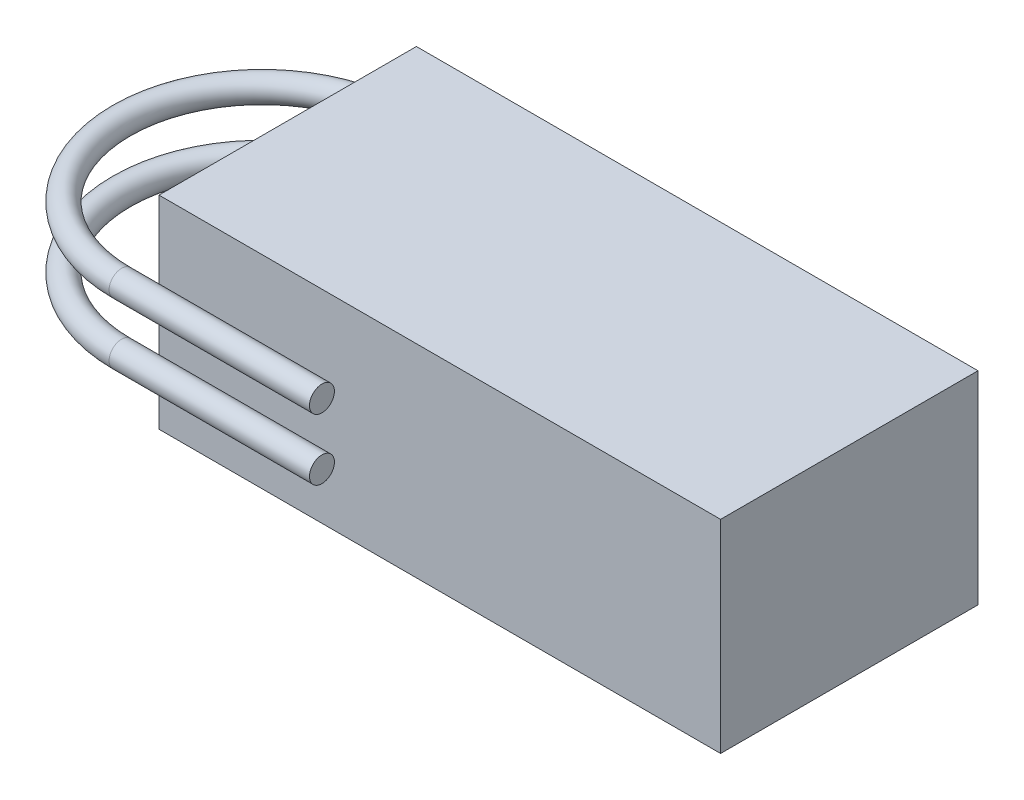
ISO-10303-21;
HEADER;
FILE_DESCRIPTION(('STEP AP214'),'2;1');
FILE_NAME('part.step','',(''),(''),'','','');
FILE_SCHEMA(('AUTOMOTIVE_DESIGN { 1 0 10303 214 1 1 1 1 }'));
ENDSEC;
DATA;
#1=APPLICATION_CONTEXT('core data for automotive mechanical design processes');
#2=APPLICATION_PROTOCOL_DEFINITION('international standard','automotive_design',2000,#1);
#3=PRODUCT_CONTEXT('',#1,'mechanical');
#4=PRODUCT('Part','Part','',(#3));
#5=PRODUCT_RELATED_PRODUCT_CATEGORY('part','',(#4));
#6=PRODUCT_DEFINITION_FORMATION('','',#4);
#7=PRODUCT_DEFINITION_CONTEXT('part definition',#1,'design');
#8=PRODUCT_DEFINITION('design','',#6,#7);
#9=PRODUCT_DEFINITION_SHAPE('','',#8);
#10=(LENGTH_UNIT() NAMED_UNIT(*) SI_UNIT(.MILLI.,.METRE.));
#11=(NAMED_UNIT(*) PLANE_ANGLE_UNIT() SI_UNIT($,.RADIAN.));
#12=(NAMED_UNIT(*) SI_UNIT($,.STERADIAN.) SOLID_ANGLE_UNIT());
#13=UNCERTAINTY_MEASURE_WITH_UNIT(LENGTH_MEASURE(1.E-05),#10,'distance_accuracy_value','');
#14=(GEOMETRIC_REPRESENTATION_CONTEXT(3) GLOBAL_UNCERTAINTY_ASSIGNED_CONTEXT((#13)) GLOBAL_UNIT_ASSIGNED_CONTEXT((#10,
#11,#12)) REPRESENTATION_CONTEXT('',''));
#15=CARTESIAN_POINT('',(0.,0.,0.));
#16=DIRECTION('',(0.,0.,1.));
#17=DIRECTION('',(1.,0.,0.));
#18=AXIS2_PLACEMENT_3D('',#15,#16,#17);
#19=CARTESIAN_POINT('',(-10.3108143385854,10.8073368201873,21.3001548651529));
#20=DIRECTION('',(-1.,0.,0.));
#21=DIRECTION('',(0.,-1.,0.));
#22=AXIS2_PLACEMENT_3D('',#19,#20,#21);
#23=PLANE('',#22);
#24=CARTESIAN_POINT('',(-10.3108143385854,10.8073368201873,21.3001548651529));
#25=DIRECTION('',(-1.,0.,0.));
#26=DIRECTION('',(0.,-1.,0.));
#27=AXIS2_PLACEMENT_3D('',#24,#25,#26);
#28=CIRCLE('',#27,1.6);
#29=CARTESIAN_POINT('',(-10.3108143385854,9.20733682018726,21.3001548651529));
#30=VERTEX_POINT('',#29);
#31=EDGE_CURVE('E115',#30,#30,#28,.T.);
#32=ORIENTED_EDGE('',*,*,#31,.F.);
#33=EDGE_LOOP('',(#32));
#34=FACE_BOUND('',#33,.T.);
#35=ADVANCED_FACE('F34',(#34),#23,.F.);
#36=CARTESIAN_POINT('',(-40.5254833995939,10.8073368201875,21.300154865153));
#37=DIRECTION('',(1.,0.,0.));
#38=DIRECTION('',(0.,1.,0.));
#39=AXIS2_PLACEMENT_3D('',#36,#37,#38);
#40=CYLINDRICAL_SURFACE('',#39,1.6);
#41=CARTESIAN_POINT('',(-36.,10.8073368201874,21.3001548651529));
#42=DIRECTION('',(1.,0.,0.));
#43=DIRECTION('',(0.,0.,-1.));
#44=AXIS2_PLACEMENT_3D('',#41,#42,#43);
#45=CIRCLE('',#44,1.6);
#46=CARTESIAN_POINT('',(-36.,10.8073368201874,22.900154865153));
#47=VERTEX_POINT('',#46);
#48=EDGE_CURVE('E43',#47,#47,#45,.T.);
#49=ORIENTED_EDGE('',*,*,#48,.T.);
#50=EDGE_LOOP('',(#49));
#51=FACE_BOUND('',#50,.T.);
#52=ORIENTED_EDGE('',*,*,#31,.T.);
#53=EDGE_LOOP('',(#52));
#54=FACE_BOUND('',#53,.T.);
#55=ADVANCED_FACE('F36',(#51,#54),#40,.T.);
#56=CARTESIAN_POINT('',(-36.,10.8073368201874,3.30015486515295));
#57=DIRECTION('',(0.,1.,0.));
#58=DIRECTION('',(0.,0.,1.));
#59=AXIS2_PLACEMENT_3D('',#56,#57,#58);
#60=TOROIDAL_SURFACE('',#59,18.,1.6);
#61=CARTESIAN_POINT('',(-35.9999999999999,10.8073368201874,-14.699845134847));
#62=DIRECTION('',(1.,0.,0.));
#63=DIRECTION('',(0.,0.,-1.));
#64=AXIS2_PLACEMENT_3D('',#61,#62,#63);
#65=CIRCLE('',#64,1.6);
#66=CARTESIAN_POINT('',(-35.9999999999999,10.8073368201874,-16.299845134847));
#67=VERTEX_POINT('',#66);
#68=EDGE_CURVE('E112',#67,#67,#65,.T.);
#69=CARTESIAN_POINT('',(-36.,10.8073368201874,3.30015486515295));
#70=DIRECTION('',(0.,1.,0.));
#71=DIRECTION('',(0.,0.,1.));
#72=AXIS2_PLACEMENT_3D('',#69,#70,#71);
#73=CIRCLE('',#72,19.6);
#74=EDGE_CURVE('',#67,#47,#73,.T.);
#75=ORIENTED_EDGE('',*,*,#68,.F.);
#76=ORIENTED_EDGE('',*,*,#48,.F.);
#77=ORIENTED_EDGE('',*,*,#74,.T.);
#78=ORIENTED_EDGE('',*,*,#74,.F.);
#79=EDGE_LOOP('',(#75,#77,#76,#78));
#80=FACE_BOUND('',#79,.T.);
#81=ADVANCED_FACE('F122',(#80),#60,.T.);
#82=CARTESIAN_POINT('',(36.,26.,16.5));
#83=DIRECTION('',(-1.,0.,0.));
#84=DIRECTION('',(0.,0.,1.));
#85=AXIS2_PLACEMENT_3D('',#82,#83,#84);
#86=PLANE('',#85);
#87=DIRECTION('',(0.,0.,-1.));
#88=VECTOR('',#87,1.);
#89=CARTESIAN_POINT('',(36.,0.,16.5));
#90=LINE('',#89,#88);
#91=CARTESIAN_POINT('',(36.,0.,16.5));
#92=VERTEX_POINT('',#91);
#93=CARTESIAN_POINT('',(36.,0.,-16.5));
#94=VERTEX_POINT('',#93);
#95=EDGE_CURVE('E102',#92,#94,#90,.T.);
#96=ORIENTED_EDGE('',*,*,#95,.T.);
#97=DIRECTION('',(0.,-1.,0.));
#98=VECTOR('',#97,1.);
#99=CARTESIAN_POINT('',(36.,26.,-16.5));
#100=LINE('',#99,#98);
#101=CARTESIAN_POINT('',(36.,26.,-16.5));
#102=VERTEX_POINT('',#101);
#103=EDGE_CURVE('E93',#102,#94,#100,.T.);
#104=ORIENTED_EDGE('',*,*,#103,.F.);
#105=DIRECTION('',(0.,0.,-1.));
#106=VECTOR('',#105,1.);
#107=CARTESIAN_POINT('',(36.,26.,16.5));
#108=LINE('',#107,#106);
#109=CARTESIAN_POINT('',(36.,26.,16.5));
#110=VERTEX_POINT('',#109);
#111=EDGE_CURVE('E87',#110,#102,#108,.T.);
#112=ORIENTED_EDGE('',*,*,#111,.F.);
#113=DIRECTION('',(0.,-1.,0.));
#114=VECTOR('',#113,1.);
#115=CARTESIAN_POINT('',(36.,26.,16.5));
#116=LINE('',#115,#114);
#117=EDGE_CURVE('E98',#110,#92,#116,.T.);
#118=ORIENTED_EDGE('',*,*,#117,.T.);
#119=EDGE_LOOP('',(#96,#104,#112,#118));
#120=FACE_BOUND('',#119,.T.);
#121=ADVANCED_FACE('F124',(#120),#86,.F.);
#122=CARTESIAN_POINT('',(-36.,26.,-16.5));
#123=DIRECTION('',(0.,0.,1.));
#124=DIRECTION('',(1.,0.,0.));
#125=AXIS2_PLACEMENT_3D('',#122,#123,#124);
#126=PLANE('',#125);
#127=DIRECTION('',(-1.,0.,0.));
#128=VECTOR('',#127,1.);
#129=CARTESIAN_POINT('',(-36.,0.,-16.5));
#130=LINE('',#129,#128);
#131=CARTESIAN_POINT('',(-36.,0.,-16.5));
#132=VERTEX_POINT('',#131);
#133=EDGE_CURVE('E92',#94,#132,#130,.T.);
#134=ORIENTED_EDGE('',*,*,#133,.T.);
#135=DIRECTION('',(0.,-1.,0.));
#136=VECTOR('',#135,1.);
#137=CARTESIAN_POINT('',(-36.,26.,-16.5));
#138=LINE('',#137,#136);
#139=CARTESIAN_POINT('',(-36.,26.,-16.5));
#140=VERTEX_POINT('',#139);
#141=EDGE_CURVE('E90',#140,#132,#138,.T.);
#142=ORIENTED_EDGE('',*,*,#141,.F.);
#143=DIRECTION('',(-1.,0.,0.));
#144=VECTOR('',#143,1.);
#145=CARTESIAN_POINT('',(-36.,26.,-16.5));
#146=LINE('',#145,#144);
#147=EDGE_CURVE('E82',#102,#140,#146,.T.);
#148=ORIENTED_EDGE('',*,*,#147,.F.);
#149=ORIENTED_EDGE('',*,*,#103,.T.);
#150=EDGE_LOOP('',(#134,#142,#148,#149));
#151=FACE_BOUND('',#150,.T.);
#152=ADVANCED_FACE('F91',(#151),#126,.F.);
#153=CARTESIAN_POINT('',(-36.,26.,16.5));
#154=DIRECTION('',(1.,0.,0.));
#155=DIRECTION('',(0.,0.,-1.));
#156=AXIS2_PLACEMENT_3D('',#153,#154,#155);
#157=PLANE('',#156);
#158=CARTESIAN_POINT('',(-36.,18.6743368201874,-14.699845134847));
#159=DIRECTION('',(1.,0.,0.));
#160=DIRECTION('',(0.,0.,-1.));
#161=AXIS2_PLACEMENT_3D('',#158,#159,#160);
#162=CIRCLE('',#161,1.6);
#163=CARTESIAN_POINT('',(-36.,18.6743368201874,-16.2998451348471));
#164=VERTEX_POINT('',#163);
#165=EDGE_CURVE('E11',#164,#164,#162,.F.);
#166=ORIENTED_EDGE('',*,*,#165,.F.);
#167=EDGE_LOOP('',(#166));
#168=FACE_BOUND('',#167,.T.);
#169=ORIENTED_EDGE('',*,*,#68,.T.);
#170=EDGE_LOOP('',(#169));
#171=FACE_BOUND('',#170,.T.);
#172=DIRECTION('',(0.,0.,1.));
#173=VECTOR('',#172,1.);
#174=CARTESIAN_POINT('',(-36.,0.,16.5));
#175=LINE('',#174,#173);
#176=CARTESIAN_POINT('',(-36.,0.,16.5));
#177=VERTEX_POINT('',#176);
#178=EDGE_CURVE('E68',#132,#177,#175,.T.);
#179=ORIENTED_EDGE('',*,*,#178,.T.);
#180=DIRECTION('',(0.,-1.,0.));
#181=VECTOR('',#180,1.);
#182=CARTESIAN_POINT('',(-36.,26.,16.5));
#183=LINE('',#182,#181);
#184=CARTESIAN_POINT('',(-36.,26.,16.5));
#185=VERTEX_POINT('',#184);
#186=EDGE_CURVE('E94',#185,#177,#183,.T.);
#187=ORIENTED_EDGE('',*,*,#186,.F.);
#188=DIRECTION('',(0.,0.,1.));
#189=VECTOR('',#188,1.);
#190=CARTESIAN_POINT('',(-36.,26.,16.5));
#191=LINE('',#190,#189);
#192=EDGE_CURVE('E85',#140,#185,#191,.T.);
#193=ORIENTED_EDGE('',*,*,#192,.F.);
#194=ORIENTED_EDGE('',*,*,#141,.T.);
#195=EDGE_LOOP('',(#179,#187,#193,#194));
#196=FACE_BOUND('',#195,.T.);
#197=ADVANCED_FACE('F96',(#168,#171,#196),#157,.F.);
#198=CARTESIAN_POINT('',(-36.,26.,16.5));
#199=DIRECTION('',(0.,0.,-1.));
#200=DIRECTION('',(-1.,0.,0.));
#201=AXIS2_PLACEMENT_3D('',#198,#199,#200);
#202=PLANE('',#201);
#203=DIRECTION('',(1.,0.,0.));
#204=VECTOR('',#203,1.);
#205=CARTESIAN_POINT('',(-36.,0.,16.5));
#206=LINE('',#205,#204);
#207=EDGE_CURVE('E74',#177,#92,#206,.T.);
#208=ORIENTED_EDGE('',*,*,#207,.T.);
#209=ORIENTED_EDGE('',*,*,#117,.F.);
#210=DIRECTION('',(1.,0.,0.));
#211=VECTOR('',#210,1.);
#212=CARTESIAN_POINT('',(-36.,26.,16.5));
#213=LINE('',#212,#211);
#214=EDGE_CURVE('E51',#185,#110,#213,.T.);
#215=ORIENTED_EDGE('',*,*,#214,.F.);
#216=ORIENTED_EDGE('',*,*,#186,.T.);
#217=EDGE_LOOP('',(#208,#209,#215,#216));
#218=FACE_BOUND('',#217,.T.);
#219=ADVANCED_FACE('F185',(#218),#202,.F.);
#220=CARTESIAN_POINT('',(0.,26.,0.));
#221=DIRECTION('',(0.,-1.,0.));
#222=DIRECTION('',(0.,0.,-1.));
#223=AXIS2_PLACEMENT_3D('',#220,#221,#222);
#224=PLANE('',#223);
#225=ORIENTED_EDGE('',*,*,#111,.T.);
#226=ORIENTED_EDGE('',*,*,#147,.T.);
#227=ORIENTED_EDGE('',*,*,#192,.T.);
#228=ORIENTED_EDGE('',*,*,#214,.T.);
#229=EDGE_LOOP('',(#225,#226,#227,#228));
#230=FACE_BOUND('',#229,.T.);
#231=ADVANCED_FACE('F83',(#230),#224,.F.);
#232=CARTESIAN_POINT('',(0.,0.,0.));
#233=DIRECTION('',(0.,-1.,0.));
#234=DIRECTION('',(0.,0.,-1.));
#235=AXIS2_PLACEMENT_3D('',#232,#233,#234);
#236=PLANE('',#235);
#237=ORIENTED_EDGE('',*,*,#95,.F.);
#238=ORIENTED_EDGE('',*,*,#207,.F.);
#239=ORIENTED_EDGE('',*,*,#178,.F.);
#240=ORIENTED_EDGE('',*,*,#133,.F.);
#241=EDGE_LOOP('',(#237,#238,#239,#240));
#242=FACE_BOUND('',#241,.T.);
#243=ADVANCED_FACE('F203',(#242),#236,.T.);
#244=CARTESIAN_POINT('',(-36.,18.6743368201874,3.30015486515295));
#245=DIRECTION('',(0.,1.,0.));
#246=DIRECTION('',(0.,0.,1.));
#247=AXIS2_PLACEMENT_3D('',#244,#245,#246);
#248=TOROIDAL_SURFACE('',#247,18.,1.6);
#249=CARTESIAN_POINT('',(-36.,18.6743368201874,21.3001548651529));
#250=DIRECTION('',(-1.,0.,0.));
#251=DIRECTION('',(0.,0.,1.));
#252=AXIS2_PLACEMENT_3D('',#249,#250,#251);
#253=CIRCLE('',#252,1.6);
#254=CARTESIAN_POINT('',(-36.,18.6743368201874,22.9001548651529));
#255=VERTEX_POINT('',#254);
#256=EDGE_CURVE('E105',#255,#255,#253,.T.);
#257=CARTESIAN_POINT('',(-36.,18.6743368201874,3.30015486515295));
#258=DIRECTION('',(0.,1.,0.));
#259=DIRECTION('',(0.,0.,1.));
#260=AXIS2_PLACEMENT_3D('',#257,#258,#259);
#261=CIRCLE('',#260,19.6);
#262=EDGE_CURVE('',#164,#255,#261,.T.);
#263=ORIENTED_EDGE('',*,*,#165,.T.);
#264=ORIENTED_EDGE('',*,*,#256,.T.);
#265=ORIENTED_EDGE('',*,*,#262,.T.);
#266=ORIENTED_EDGE('',*,*,#262,.F.);
#267=EDGE_LOOP('',(#263,#265,#264,#266));
#268=FACE_BOUND('',#267,.T.);
#269=ADVANCED_FACE('F212',(#268),#248,.T.);
#270=CARTESIAN_POINT('',(-10.3108143385854,18.6743368201873,21.3001548651529));
#271=DIRECTION('',(-1.,0.,0.));
#272=DIRECTION('',(0.,-1.,0.));
#273=AXIS2_PLACEMENT_3D('',#270,#271,#272);
#274=PLANE('',#273);
#275=CARTESIAN_POINT('',(-10.3108143385854,18.6743368201873,21.3001548651529));
#276=DIRECTION('',(-1.,0.,0.));
#277=DIRECTION('',(0.,-1.,0.));
#278=AXIS2_PLACEMENT_3D('',#275,#276,#277);
#279=CIRCLE('',#278,1.6);
#280=CARTESIAN_POINT('',(-10.3108143385854,17.0743368201873,21.3001548651529));
#281=VERTEX_POINT('',#280);
#282=EDGE_CURVE('E249',#281,#281,#279,.T.);
#283=ORIENTED_EDGE('',*,*,#282,.F.);
#284=EDGE_LOOP('',(#283));
#285=FACE_BOUND('',#284,.T.);
#286=ADVANCED_FACE('F222',(#285),#274,.F.);
#287=CARTESIAN_POINT('',(-40.5254833995939,18.6743368201875,21.300154865153));
#288=DIRECTION('',(1.,0.,0.));
#289=DIRECTION('',(0.,1.,0.));
#290=AXIS2_PLACEMENT_3D('',#287,#288,#289);
#291=CYLINDRICAL_SURFACE('',#290,1.6);
#292=ORIENTED_EDGE('',*,*,#256,.F.);
#293=EDGE_LOOP('',(#292));
#294=FACE_BOUND('',#293,.T.);
#295=ORIENTED_EDGE('',*,*,#282,.T.);
#296=EDGE_LOOP('',(#295));
#297=FACE_BOUND('',#296,.T.);
#298=ADVANCED_FACE('F231',(#294,#297),#291,.T.);
#299=CLOSED_SHELL('',(#35,#55,#81,#121,#152,#197,#219,#231,#243,#269,#286,#298));
#300=MANIFOLD_SOLID_BREP('B2',#299);
#301=ADVANCED_BREP_SHAPE_REPRESENTATION('',(#18,#300),#14);
#302=SHAPE_DEFINITION_REPRESENTATION(#9,#301);
ENDSEC;
END-ISO-10303-21;
